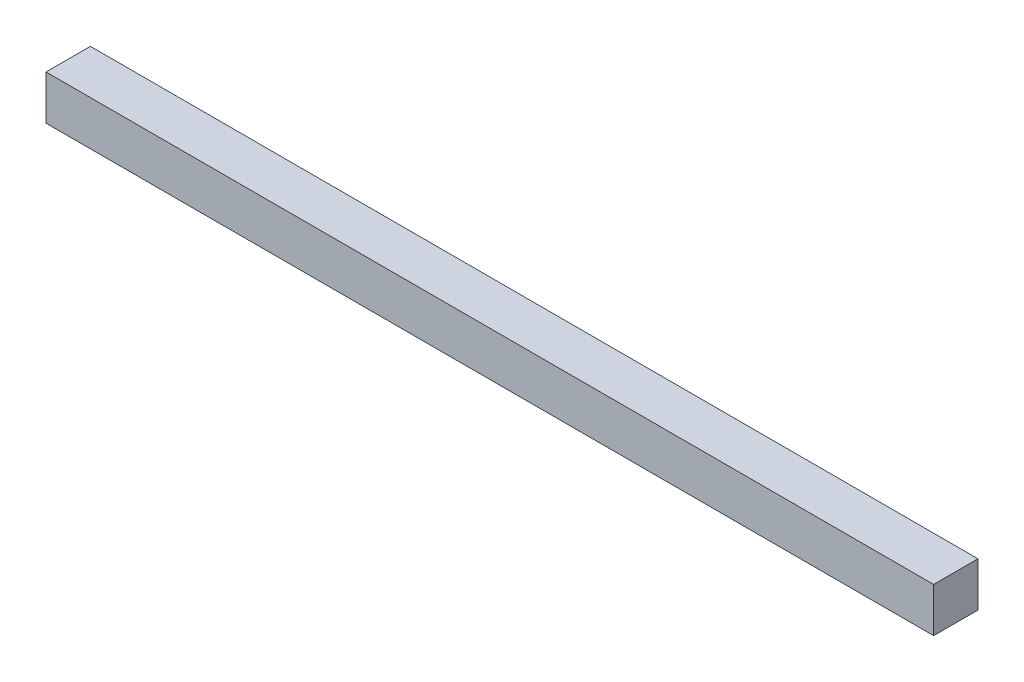
ISO-10303-21;
HEADER;
FILE_DESCRIPTION(('STEP AP214'),'2;1');
FILE_NAME('part.step','',(''),(''),'','','');
FILE_SCHEMA(('AUTOMOTIVE_DESIGN { 1 0 10303 214 1 1 1 1 }'));
ENDSEC;
DATA;
#1=APPLICATION_CONTEXT('core data for automotive mechanical design processes');
#2=APPLICATION_PROTOCOL_DEFINITION('international standard','automotive_design',2000,#1);
#3=PRODUCT_CONTEXT('',#1,'mechanical');
#4=PRODUCT('Part','Part','',(#3));
#5=PRODUCT_RELATED_PRODUCT_CATEGORY('part','',(#4));
#6=PRODUCT_DEFINITION_FORMATION('','',#4);
#7=PRODUCT_DEFINITION_CONTEXT('part definition',#1,'design');
#8=PRODUCT_DEFINITION('design','',#6,#7);
#9=PRODUCT_DEFINITION_SHAPE('','',#8);
#10=(LENGTH_UNIT() NAMED_UNIT(*) SI_UNIT(.MILLI.,.METRE.));
#11=(NAMED_UNIT(*) PLANE_ANGLE_UNIT() SI_UNIT($,.RADIAN.));
#12=(NAMED_UNIT(*) SI_UNIT($,.STERADIAN.) SOLID_ANGLE_UNIT());
#13=UNCERTAINTY_MEASURE_WITH_UNIT(LENGTH_MEASURE(1.E-05),#10,'distance_accuracy_value','');
#14=(GEOMETRIC_REPRESENTATION_CONTEXT(3) GLOBAL_UNCERTAINTY_ASSIGNED_CONTEXT((#13)) GLOBAL_UNIT_ASSIGNED_CONTEXT((#10,
#11,#12)) REPRESENTATION_CONTEXT('',''));
#15=CARTESIAN_POINT('',(0.,0.,0.));
#16=DIRECTION('',(0.,0.,1.));
#17=DIRECTION('',(1.,0.,0.));
#18=AXIS2_PLACEMENT_3D('',#15,#16,#17);
#19=CARTESIAN_POINT('',(5000.,-250.,500.));
#20=DIRECTION('',(-1.,0.,0.));
#21=DIRECTION('',(0.,0.,1.));
#22=AXIS2_PLACEMENT_3D('',#19,#20,#21);
#23=PLANE('',#22);
#24=DIRECTION('',(0.,1.,0.));
#25=VECTOR('',#24,1.);
#26=CARTESIAN_POINT('',(5000.,-250.,0.));
#27=LINE('',#26,#25);
#28=CARTESIAN_POINT('',(5000.,-250.,0.));
#29=VERTEX_POINT('',#28);
#30=CARTESIAN_POINT('',(5000.,250.,0.));
#31=VERTEX_POINT('',#30);
#32=EDGE_CURVE('E96',#29,#31,#27,.T.);
#33=ORIENTED_EDGE('',*,*,#32,.T.);
#34=DIRECTION('',(0.,0.,-1.));
#35=VECTOR('',#34,1.);
#36=CARTESIAN_POINT('',(5000.,250.,500.));
#37=LINE('',#36,#35);
#38=CARTESIAN_POINT('',(5000.,250.,500.));
#39=VERTEX_POINT('',#38);
#40=EDGE_CURVE('E11',#39,#31,#37,.T.);
#41=ORIENTED_EDGE('',*,*,#40,.F.);
#42=DIRECTION('',(0.,1.,0.));
#43=VECTOR('',#42,1.);
#44=CARTESIAN_POINT('',(5000.,-250.,500.));
#45=LINE('',#44,#43);
#46=CARTESIAN_POINT('',(5000.,-250.,500.));
#47=VERTEX_POINT('',#46);
#48=EDGE_CURVE('E84',#47,#39,#45,.T.);
#49=ORIENTED_EDGE('',*,*,#48,.F.);
#50=DIRECTION('',(0.,0.,-1.));
#51=VECTOR('',#50,1.);
#52=CARTESIAN_POINT('',(5000.,-250.,500.));
#53=LINE('',#52,#51);
#54=EDGE_CURVE('E92',#47,#29,#53,.T.);
#55=ORIENTED_EDGE('',*,*,#54,.T.);
#56=EDGE_LOOP('',(#33,#41,#49,#55));
#57=FACE_BOUND('',#56,.T.);
#58=ADVANCED_FACE('F33',(#57),#23,.F.);
#59=CARTESIAN_POINT('',(-5000.,250.,500.));
#60=DIRECTION('',(0.,-1.,0.));
#61=DIRECTION('',(0.,0.,-1.));
#62=AXIS2_PLACEMENT_3D('',#59,#60,#61);
#63=PLANE('',#62);
#64=DIRECTION('',(-1.,0.,0.));
#65=VECTOR('',#64,1.);
#66=CARTESIAN_POINT('',(-5000.,250.,0.));
#67=LINE('',#66,#65);
#68=CARTESIAN_POINT('',(-5000.,250.,0.));
#69=VERTEX_POINT('',#68);
#70=EDGE_CURVE('E88',#31,#69,#67,.T.);
#71=ORIENTED_EDGE('',*,*,#70,.T.);
#72=DIRECTION('',(0.,0.,-1.));
#73=VECTOR('',#72,1.);
#74=CARTESIAN_POINT('',(-5000.,250.,500.));
#75=LINE('',#74,#73);
#76=CARTESIAN_POINT('',(-5000.,250.,500.));
#77=VERTEX_POINT('',#76);
#78=EDGE_CURVE('E41',#77,#69,#75,.T.);
#79=ORIENTED_EDGE('',*,*,#78,.F.);
#80=DIRECTION('',(-1.,0.,0.));
#81=VECTOR('',#80,1.);
#82=CARTESIAN_POINT('',(-5000.,250.,500.));
#83=LINE('',#82,#81);
#84=EDGE_CURVE('E79',#39,#77,#83,.T.);
#85=ORIENTED_EDGE('',*,*,#84,.F.);
#86=ORIENTED_EDGE('',*,*,#40,.T.);
#87=EDGE_LOOP('',(#71,#79,#85,#86));
#88=FACE_BOUND('',#87,.T.);
#89=ADVANCED_FACE('F87',(#88),#63,.F.);
#90=CARTESIAN_POINT('',(-5000.,-250.,500.));
#91=DIRECTION('',(1.,0.,0.));
#92=DIRECTION('',(0.,0.,-1.));
#93=AXIS2_PLACEMENT_3D('',#90,#91,#92);
#94=PLANE('',#93);
#95=DIRECTION('',(0.,-1.,0.));
#96=VECTOR('',#95,1.);
#97=CARTESIAN_POINT('',(-5000.,-250.,0.));
#98=LINE('',#97,#96);
#99=CARTESIAN_POINT('',(-5000.,-250.,0.));
#100=VERTEX_POINT('',#99);
#101=EDGE_CURVE('E66',#69,#100,#98,.T.);
#102=ORIENTED_EDGE('',*,*,#101,.T.);
#103=DIRECTION('',(0.,0.,-1.));
#104=VECTOR('',#103,1.);
#105=CARTESIAN_POINT('',(-5000.,-250.,500.));
#106=LINE('',#105,#104);
#107=CARTESIAN_POINT('',(-5000.,-250.,500.));
#108=VERTEX_POINT('',#107);
#109=EDGE_CURVE('E89',#108,#100,#106,.T.);
#110=ORIENTED_EDGE('',*,*,#109,.F.);
#111=DIRECTION('',(0.,-1.,0.));
#112=VECTOR('',#111,1.);
#113=CARTESIAN_POINT('',(-5000.,-250.,500.));
#114=LINE('',#113,#112);
#115=EDGE_CURVE('E82',#77,#108,#114,.T.);
#116=ORIENTED_EDGE('',*,*,#115,.F.);
#117=ORIENTED_EDGE('',*,*,#78,.T.);
#118=EDGE_LOOP('',(#102,#110,#116,#117));
#119=FACE_BOUND('',#118,.T.);
#120=ADVANCED_FACE('F90',(#119),#94,.F.);
#121=CARTESIAN_POINT('',(-5000.,-250.,500.));
#122=DIRECTION('',(0.,1.,0.));
#123=DIRECTION('',(0.,0.,1.));
#124=AXIS2_PLACEMENT_3D('',#121,#122,#123);
#125=PLANE('',#124);
#126=DIRECTION('',(1.,0.,0.));
#127=VECTOR('',#126,1.);
#128=CARTESIAN_POINT('',(-5000.,-250.,0.));
#129=LINE('',#128,#127);
#130=EDGE_CURVE('E72',#100,#29,#129,.T.);
#131=ORIENTED_EDGE('',*,*,#130,.T.);
#132=ORIENTED_EDGE('',*,*,#54,.F.);
#133=DIRECTION('',(1.,0.,0.));
#134=VECTOR('',#133,1.);
#135=CARTESIAN_POINT('',(-5000.,-250.,500.));
#136=LINE('',#135,#134);
#137=EDGE_CURVE('E49',#108,#47,#136,.T.);
#138=ORIENTED_EDGE('',*,*,#137,.F.);
#139=ORIENTED_EDGE('',*,*,#109,.T.);
#140=EDGE_LOOP('',(#131,#132,#138,#139));
#141=FACE_BOUND('',#140,.T.);
#142=ADVANCED_FACE('F103',(#141),#125,.F.);
#143=CARTESIAN_POINT('',(0.,0.,500.));
#144=DIRECTION('',(0.,0.,-1.));
#145=DIRECTION('',(-1.,0.,0.));
#146=AXIS2_PLACEMENT_3D('',#143,#144,#145);
#147=PLANE('',#146);
#148=ORIENTED_EDGE('',*,*,#48,.T.);
#149=ORIENTED_EDGE('',*,*,#84,.T.);
#150=ORIENTED_EDGE('',*,*,#115,.T.);
#151=ORIENTED_EDGE('',*,*,#137,.T.);
#152=EDGE_LOOP('',(#148,#149,#150,#151));
#153=FACE_BOUND('',#152,.T.);
#154=ADVANCED_FACE('F80',(#153),#147,.F.);
#155=CARTESIAN_POINT('',(0.,0.,0.));
#156=DIRECTION('',(0.,0.,-1.));
#157=DIRECTION('',(-1.,0.,0.));
#158=AXIS2_PLACEMENT_3D('',#155,#156,#157);
#159=PLANE('',#158);
#160=ORIENTED_EDGE('',*,*,#32,.F.);
#161=ORIENTED_EDGE('',*,*,#130,.F.);
#162=ORIENTED_EDGE('',*,*,#101,.F.);
#163=ORIENTED_EDGE('',*,*,#70,.F.);
#164=EDGE_LOOP('',(#160,#161,#162,#163));
#165=FACE_BOUND('',#164,.T.);
#166=ADVANCED_FACE('F106',(#165),#159,.T.);
#167=CLOSED_SHELL('',(#58,#89,#120,#142,#154,#166));
#168=MANIFOLD_SOLID_BREP('B2',#167);
#169=ADVANCED_BREP_SHAPE_REPRESENTATION('',(#18,#168),#14);
#170=SHAPE_DEFINITION_REPRESENTATION(#9,#169);
ENDSEC;
END-ISO-10303-21;
